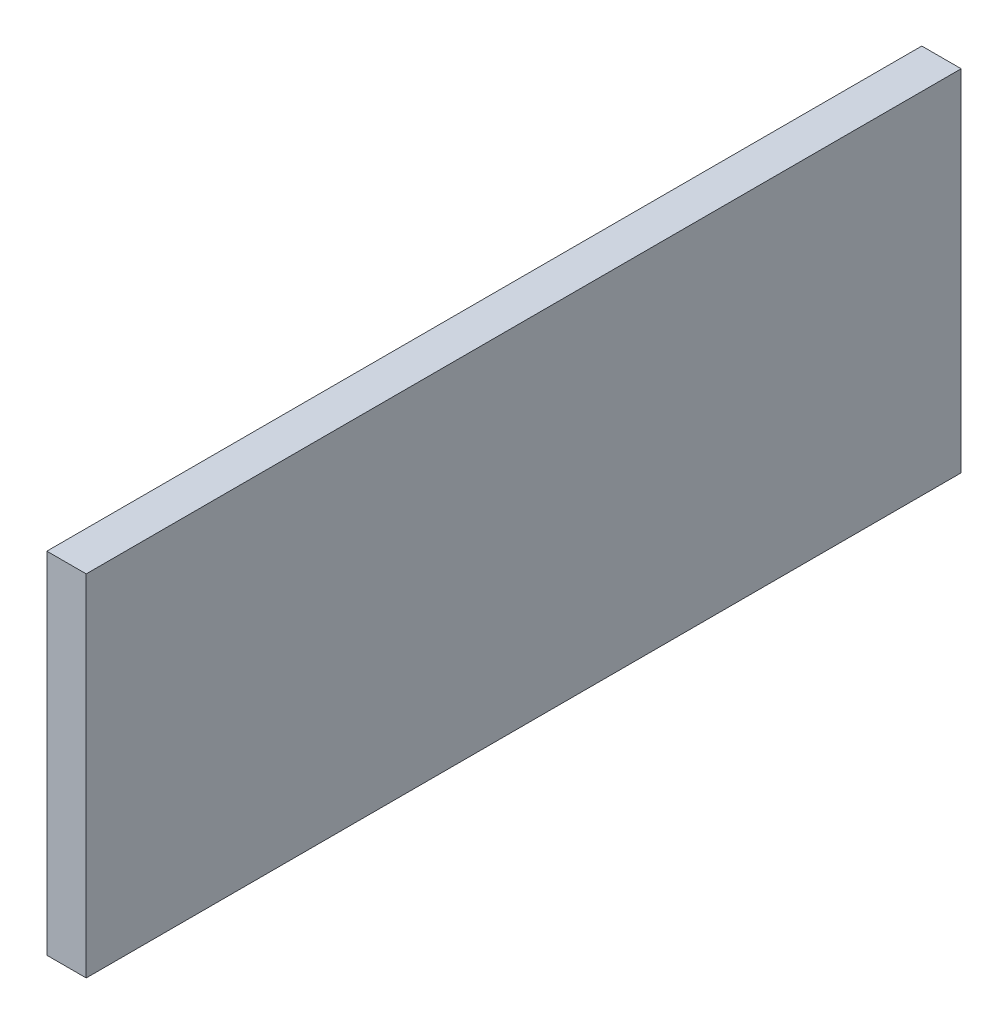
ISO-10303-21;
HEADER;
FILE_DESCRIPTION(('STEP AP214'),'2;1');
FILE_NAME('part.step','',(''),(''),'','','');
FILE_SCHEMA(('AUTOMOTIVE_DESIGN { 1 0 10303 214 1 1 1 1 }'));
ENDSEC;
DATA;
#1=APPLICATION_CONTEXT('core data for automotive mechanical design processes');
#2=APPLICATION_PROTOCOL_DEFINITION('international standard','automotive_design',2000,#1);
#3=PRODUCT_CONTEXT('',#1,'mechanical');
#4=PRODUCT('Part','Part','',(#3));
#5=PRODUCT_RELATED_PRODUCT_CATEGORY('part','',(#4));
#6=PRODUCT_DEFINITION_FORMATION('','',#4);
#7=PRODUCT_DEFINITION_CONTEXT('part definition',#1,'design');
#8=PRODUCT_DEFINITION('design','',#6,#7);
#9=PRODUCT_DEFINITION_SHAPE('','',#8);
#10=(LENGTH_UNIT() NAMED_UNIT(*) SI_UNIT(.MILLI.,.METRE.));
#11=(NAMED_UNIT(*) PLANE_ANGLE_UNIT() SI_UNIT($,.RADIAN.));
#12=(NAMED_UNIT(*) SI_UNIT($,.STERADIAN.) SOLID_ANGLE_UNIT());
#13=UNCERTAINTY_MEASURE_WITH_UNIT(LENGTH_MEASURE(1.E-05),#10,'distance_accuracy_value','');
#14=(GEOMETRIC_REPRESENTATION_CONTEXT(3) GLOBAL_UNCERTAINTY_ASSIGNED_CONTEXT((#13)) GLOBAL_UNIT_ASSIGNED_CONTEXT((#10,
#11,#12)) REPRESENTATION_CONTEXT('',''));
#15=CARTESIAN_POINT('',(0.,0.,0.));
#16=DIRECTION('',(0.,0.,1.));
#17=DIRECTION('',(1.,0.,0.));
#18=AXIS2_PLACEMENT_3D('',#15,#16,#17);
#19=CARTESIAN_POINT('',(18.,7.25357950022601,29.014318000904));
#20=DIRECTION('',(0.,0.,-1.));
#21=DIRECTION('',(0.,1.,0.));
#22=AXIS2_PLACEMENT_3D('',#19,#20,#21);
#23=PLANE('',#22);
#24=DIRECTION('',(0.,-1.,0.));
#25=VECTOR('',#24,1.);
#26=CARTESIAN_POINT('',(0.,7.25357950022601,29.014318000904));
#27=LINE('',#26,#25);
#28=CARTESIAN_POINT('',(0.,7.25357950022601,29.014318000904));
#29=VERTEX_POINT('',#28);
#30=CARTESIAN_POINT('',(0.,-152.746420499774,29.014318000904));
#31=VERTEX_POINT('',#30);
#32=EDGE_CURVE('E96',#29,#31,#27,.T.);
#33=ORIENTED_EDGE('',*,*,#32,.T.);
#34=DIRECTION('',(-1.,0.,0.));
#35=VECTOR('',#34,1.);
#36=CARTESIAN_POINT('',(18.,-152.746420499774,29.014318000904));
#37=LINE('',#36,#35);
#38=CARTESIAN_POINT('',(18.,-152.746420499774,29.014318000904));
#39=VERTEX_POINT('',#38);
#40=EDGE_CURVE('E11',#39,#31,#37,.T.);
#41=ORIENTED_EDGE('',*,*,#40,.F.);
#42=DIRECTION('',(0.,-1.,0.));
#43=VECTOR('',#42,1.);
#44=CARTESIAN_POINT('',(18.,7.25357950022601,29.014318000904));
#45=LINE('',#44,#43);
#46=CARTESIAN_POINT('',(18.,7.25357950022601,29.014318000904));
#47=VERTEX_POINT('',#46);
#48=EDGE_CURVE('E84',#47,#39,#45,.T.);
#49=ORIENTED_EDGE('',*,*,#48,.F.);
#50=DIRECTION('',(-1.,0.,0.));
#51=VECTOR('',#50,1.);
#52=CARTESIAN_POINT('',(18.,7.25357950022601,29.014318000904));
#53=LINE('',#52,#51);
#54=EDGE_CURVE('E92',#47,#29,#53,.T.);
#55=ORIENTED_EDGE('',*,*,#54,.T.);
#56=EDGE_LOOP('',(#33,#41,#49,#55));
#57=FACE_BOUND('',#56,.T.);
#58=ADVANCED_FACE('F33',(#57),#23,.F.);
#59=CARTESIAN_POINT('',(18.,-152.746420499774,29.014318000904));
#60=DIRECTION('',(0.,1.,0.));
#61=DIRECTION('',(0.,0.,1.));
#62=AXIS2_PLACEMENT_3D('',#59,#60,#61);
#63=PLANE('',#62);
#64=DIRECTION('',(0.,0.,-1.));
#65=VECTOR('',#64,1.);
#66=CARTESIAN_POINT('',(0.,-152.746420499774,29.014318000904));
#67=LINE('',#66,#65);
#68=CARTESIAN_POINT('',(0.,-152.746420499774,-370.985681999096));
#69=VERTEX_POINT('',#68);
#70=EDGE_CURVE('E88',#31,#69,#67,.T.);
#71=ORIENTED_EDGE('',*,*,#70,.T.);
#72=DIRECTION('',(-1.,0.,0.));
#73=VECTOR('',#72,1.);
#74=CARTESIAN_POINT('',(18.,-152.746420499774,-370.985681999096));
#75=LINE('',#74,#73);
#76=CARTESIAN_POINT('',(18.,-152.746420499774,-370.985681999096));
#77=VERTEX_POINT('',#76);
#78=EDGE_CURVE('E41',#77,#69,#75,.T.);
#79=ORIENTED_EDGE('',*,*,#78,.F.);
#80=DIRECTION('',(0.,0.,-1.));
#81=VECTOR('',#80,1.);
#82=CARTESIAN_POINT('',(18.,-152.746420499774,29.014318000904));
#83=LINE('',#82,#81);
#84=EDGE_CURVE('E79',#39,#77,#83,.T.);
#85=ORIENTED_EDGE('',*,*,#84,.F.);
#86=ORIENTED_EDGE('',*,*,#40,.T.);
#87=EDGE_LOOP('',(#71,#79,#85,#86));
#88=FACE_BOUND('',#87,.T.);
#89=ADVANCED_FACE('F87',(#88),#63,.F.);
#90=CARTESIAN_POINT('',(18.,7.25357950022601,-370.985681999096));
#91=DIRECTION('',(0.,0.,1.));
#92=DIRECTION('',(1.,0.,0.));
#93=AXIS2_PLACEMENT_3D('',#90,#91,#92);
#94=PLANE('',#93);
#95=DIRECTION('',(0.,1.,0.));
#96=VECTOR('',#95,1.);
#97=CARTESIAN_POINT('',(0.,7.25357950022601,-370.985681999096));
#98=LINE('',#97,#96);
#99=CARTESIAN_POINT('',(0.,7.25357950022601,-370.985681999096));
#100=VERTEX_POINT('',#99);
#101=EDGE_CURVE('E66',#69,#100,#98,.T.);
#102=ORIENTED_EDGE('',*,*,#101,.T.);
#103=DIRECTION('',(-1.,0.,0.));
#104=VECTOR('',#103,1.);
#105=CARTESIAN_POINT('',(18.,7.25357950022601,-370.985681999096));
#106=LINE('',#105,#104);
#107=CARTESIAN_POINT('',(18.,7.25357950022601,-370.985681999096));
#108=VERTEX_POINT('',#107);
#109=EDGE_CURVE('E89',#108,#100,#106,.T.);
#110=ORIENTED_EDGE('',*,*,#109,.F.);
#111=DIRECTION('',(0.,1.,0.));
#112=VECTOR('',#111,1.);
#113=CARTESIAN_POINT('',(18.,7.25357950022601,-370.985681999096));
#114=LINE('',#113,#112);
#115=EDGE_CURVE('E82',#77,#108,#114,.T.);
#116=ORIENTED_EDGE('',*,*,#115,.F.);
#117=ORIENTED_EDGE('',*,*,#78,.T.);
#118=EDGE_LOOP('',(#102,#110,#116,#117));
#119=FACE_BOUND('',#118,.T.);
#120=ADVANCED_FACE('F90',(#119),#94,.F.);
#121=CARTESIAN_POINT('',(18.,7.25357950022601,29.014318000904));
#122=DIRECTION('',(0.,-1.,0.));
#123=DIRECTION('',(0.,0.,-1.));
#124=AXIS2_PLACEMENT_3D('',#121,#122,#123);
#125=PLANE('',#124);
#126=DIRECTION('',(0.,0.,1.));
#127=VECTOR('',#126,1.);
#128=CARTESIAN_POINT('',(0.,7.25357950022601,29.014318000904));
#129=LINE('',#128,#127);
#130=EDGE_CURVE('E72',#100,#29,#129,.T.);
#131=ORIENTED_EDGE('',*,*,#130,.T.);
#132=ORIENTED_EDGE('',*,*,#54,.F.);
#133=DIRECTION('',(0.,0.,1.));
#134=VECTOR('',#133,1.);
#135=CARTESIAN_POINT('',(18.,7.25357950022601,29.014318000904));
#136=LINE('',#135,#134);
#137=EDGE_CURVE('E49',#108,#47,#136,.T.);
#138=ORIENTED_EDGE('',*,*,#137,.F.);
#139=ORIENTED_EDGE('',*,*,#109,.T.);
#140=EDGE_LOOP('',(#131,#132,#138,#139));
#141=FACE_BOUND('',#140,.T.);
#142=ADVANCED_FACE('F103',(#141),#125,.F.);
#143=CARTESIAN_POINT('',(18.,0.,0.));
#144=DIRECTION('',(1.,0.,0.));
#145=DIRECTION('',(0.,0.,-1.));
#146=AXIS2_PLACEMENT_3D('',#143,#144,#145);
#147=PLANE('',#146);
#148=ORIENTED_EDGE('',*,*,#48,.T.);
#149=ORIENTED_EDGE('',*,*,#84,.T.);
#150=ORIENTED_EDGE('',*,*,#115,.T.);
#151=ORIENTED_EDGE('',*,*,#137,.T.);
#152=EDGE_LOOP('',(#148,#149,#150,#151));
#153=FACE_BOUND('',#152,.T.);
#154=ADVANCED_FACE('F80',(#153),#147,.T.);
#155=CARTESIAN_POINT('',(0.,0.,0.));
#156=DIRECTION('',(1.,0.,0.));
#157=DIRECTION('',(0.,0.,-1.));
#158=AXIS2_PLACEMENT_3D('',#155,#156,#157);
#159=PLANE('',#158);
#160=ORIENTED_EDGE('',*,*,#32,.F.);
#161=ORIENTED_EDGE('',*,*,#130,.F.);
#162=ORIENTED_EDGE('',*,*,#101,.F.);
#163=ORIENTED_EDGE('',*,*,#70,.F.);
#164=EDGE_LOOP('',(#160,#161,#162,#163));
#165=FACE_BOUND('',#164,.T.);
#166=ADVANCED_FACE('F106',(#165),#159,.F.);
#167=CLOSED_SHELL('',(#58,#89,#120,#142,#154,#166));
#168=MANIFOLD_SOLID_BREP('B2',#167);
#169=ADVANCED_BREP_SHAPE_REPRESENTATION('',(#18,#168),#14);
#170=SHAPE_DEFINITION_REPRESENTATION(#9,#169);
ENDSEC;
END-ISO-10303-21;
